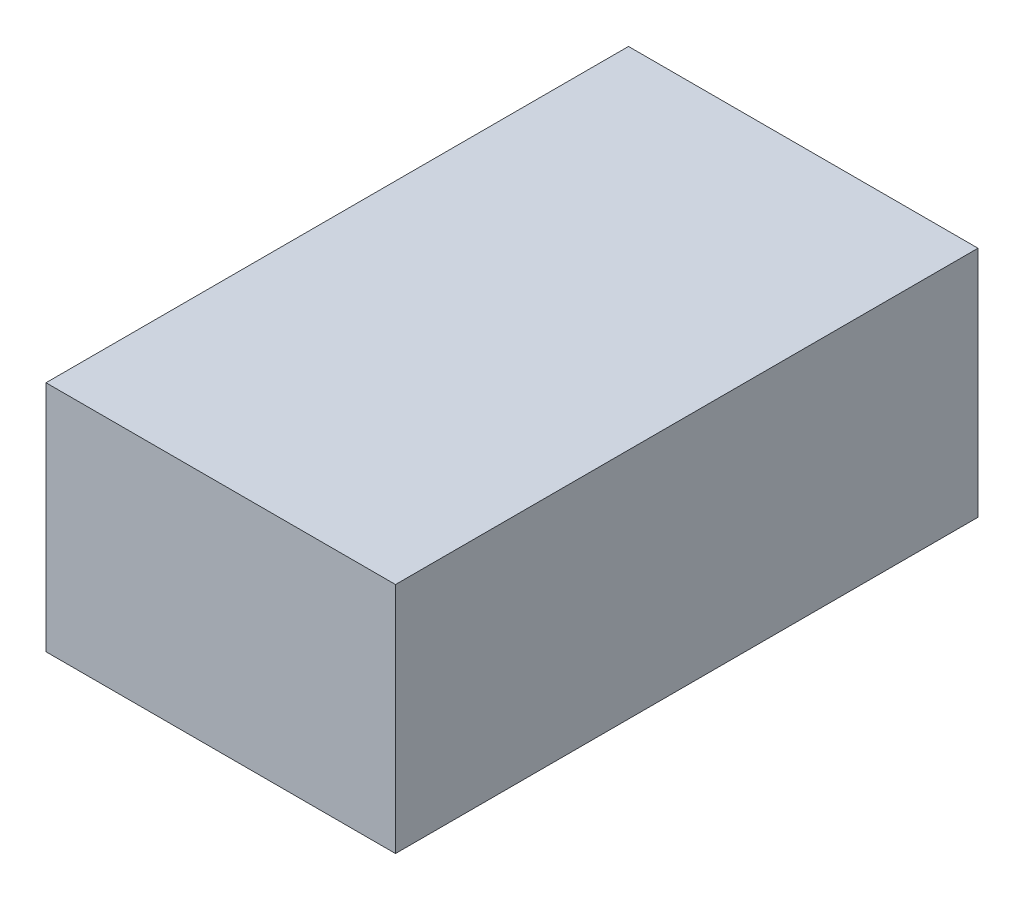
ISO-10303-21;
HEADER;
FILE_DESCRIPTION(('STEP AP214'),'2;1');
FILE_NAME('part.step','',(''),(''),'','','');
FILE_SCHEMA(('AUTOMOTIVE_DESIGN { 1 0 10303 214 1 1 1 1 }'));
ENDSEC;
DATA;
#1=APPLICATION_CONTEXT('core data for automotive mechanical design processes');
#2=APPLICATION_PROTOCOL_DEFINITION('international standard','automotive_design',2000,#1);
#3=PRODUCT_CONTEXT('',#1,'mechanical');
#4=PRODUCT('Part','Part','',(#3));
#5=PRODUCT_RELATED_PRODUCT_CATEGORY('part','',(#4));
#6=PRODUCT_DEFINITION_FORMATION('','',#4);
#7=PRODUCT_DEFINITION_CONTEXT('part definition',#1,'design');
#8=PRODUCT_DEFINITION('design','',#6,#7);
#9=PRODUCT_DEFINITION_SHAPE('','',#8);
#10=(LENGTH_UNIT() NAMED_UNIT(*) SI_UNIT(.MILLI.,.METRE.));
#11=(NAMED_UNIT(*) PLANE_ANGLE_UNIT() SI_UNIT($,.RADIAN.));
#12=(NAMED_UNIT(*) SI_UNIT($,.STERADIAN.) SOLID_ANGLE_UNIT());
#13=UNCERTAINTY_MEASURE_WITH_UNIT(LENGTH_MEASURE(1.E-05),#10,'distance_accuracy_value','');
#14=(GEOMETRIC_REPRESENTATION_CONTEXT(3) GLOBAL_UNCERTAINTY_ASSIGNED_CONTEXT((#13)) GLOBAL_UNIT_ASSIGNED_CONTEXT((#10,
#11,#12)) REPRESENTATION_CONTEXT('',''));
#15=CARTESIAN_POINT('',(0.,0.,0.));
#16=DIRECTION('',(0.,0.,1.));
#17=DIRECTION('',(1.,0.,0.));
#18=AXIS2_PLACEMENT_3D('',#15,#16,#17);
#19=CARTESIAN_POINT('',(0.3,0.4,-0.5));
#20=DIRECTION('',(-1.,0.,0.));
#21=DIRECTION('',(0.,0.,1.));
#22=AXIS2_PLACEMENT_3D('',#19,#20,#21);
#23=PLANE('',#22);
#24=DIRECTION('',(0.,0.,-1.));
#25=VECTOR('',#24,1.);
#26=CARTESIAN_POINT('',(0.3,0.,-0.5));
#27=LINE('',#26,#25);
#28=CARTESIAN_POINT('',(0.3,0.,0.5));
#29=VERTEX_POINT('',#28);
#30=CARTESIAN_POINT('',(0.3,0.,-0.5));
#31=VERTEX_POINT('',#30);
#32=EDGE_CURVE('E100',#29,#31,#27,.T.);
#33=ORIENTED_EDGE('',*,*,#32,.T.);
#34=DIRECTION('',(0.,-1.,0.));
#35=VECTOR('',#34,1.);
#36=CARTESIAN_POINT('',(0.3,0.4,-0.5));
#37=LINE('',#36,#35);
#38=CARTESIAN_POINT('',(0.3,0.4,-0.5));
#39=VERTEX_POINT('',#38);
#40=EDGE_CURVE('E11',#39,#31,#37,.T.);
#41=ORIENTED_EDGE('',*,*,#40,.F.);
#42=DIRECTION('',(0.,0.,-1.));
#43=VECTOR('',#42,1.);
#44=CARTESIAN_POINT('',(0.3,0.4,-0.5));
#45=LINE('',#44,#43);
#46=CARTESIAN_POINT('',(0.3,0.4,0.5));
#47=VERTEX_POINT('',#46);
#48=EDGE_CURVE('E88',#47,#39,#45,.T.);
#49=ORIENTED_EDGE('',*,*,#48,.F.);
#50=DIRECTION('',(0.,-1.,0.));
#51=VECTOR('',#50,1.);
#52=CARTESIAN_POINT('',(0.3,0.4,0.5));
#53=LINE('',#52,#51);
#54=EDGE_CURVE('E96',#47,#29,#53,.T.);
#55=ORIENTED_EDGE('',*,*,#54,.T.);
#56=EDGE_LOOP('',(#33,#41,#49,#55));
#57=FACE_BOUND('',#56,.T.);
#58=ADVANCED_FACE('F37',(#57),#23,.F.);
#59=CARTESIAN_POINT('',(-0.3,0.4,-0.5));
#60=DIRECTION('',(0.,0.,1.));
#61=DIRECTION('',(1.,0.,0.));
#62=AXIS2_PLACEMENT_3D('',#59,#60,#61);
#63=PLANE('',#62);
#64=DIRECTION('',(-1.,0.,0.));
#65=VECTOR('',#64,1.);
#66=CARTESIAN_POINT('',(-0.3,0.,-0.5));
#67=LINE('',#66,#65);
#68=CARTESIAN_POINT('',(-0.3,0.,-0.5));
#69=VERTEX_POINT('',#68);
#70=EDGE_CURVE('E92',#31,#69,#67,.T.);
#71=ORIENTED_EDGE('',*,*,#70,.T.);
#72=DIRECTION('',(0.,-1.,0.));
#73=VECTOR('',#72,1.);
#74=CARTESIAN_POINT('',(-0.3,0.4,-0.5));
#75=LINE('',#74,#73);
#76=CARTESIAN_POINT('',(-0.3,0.4,-0.5));
#77=VERTEX_POINT('',#76);
#78=EDGE_CURVE('E45',#77,#69,#75,.T.);
#79=ORIENTED_EDGE('',*,*,#78,.F.);
#80=DIRECTION('',(-1.,0.,0.));
#81=VECTOR('',#80,1.);
#82=CARTESIAN_POINT('',(-0.3,0.4,-0.5));
#83=LINE('',#82,#81);
#84=EDGE_CURVE('E83',#39,#77,#83,.T.);
#85=ORIENTED_EDGE('',*,*,#84,.F.);
#86=ORIENTED_EDGE('',*,*,#40,.T.);
#87=EDGE_LOOP('',(#71,#79,#85,#86));
#88=FACE_BOUND('',#87,.T.);
#89=ADVANCED_FACE('F91',(#88),#63,.F.);
#90=CARTESIAN_POINT('',(-0.3,0.4,-0.5));
#91=DIRECTION('',(1.,0.,0.));
#92=DIRECTION('',(0.,0.,-1.));
#93=AXIS2_PLACEMENT_3D('',#90,#91,#92);
#94=PLANE('',#93);
#95=DIRECTION('',(0.,0.,1.));
#96=VECTOR('',#95,1.);
#97=CARTESIAN_POINT('',(-0.3,0.,-0.5));
#98=LINE('',#97,#96);
#99=CARTESIAN_POINT('',(-0.3,0.,0.5));
#100=VERTEX_POINT('',#99);
#101=EDGE_CURVE('E70',#69,#100,#98,.T.);
#102=ORIENTED_EDGE('',*,*,#101,.T.);
#103=DIRECTION('',(0.,-1.,0.));
#104=VECTOR('',#103,1.);
#105=CARTESIAN_POINT('',(-0.3,0.4,0.5));
#106=LINE('',#105,#104);
#107=CARTESIAN_POINT('',(-0.3,0.4,0.5));
#108=VERTEX_POINT('',#107);
#109=EDGE_CURVE('E93',#108,#100,#106,.T.);
#110=ORIENTED_EDGE('',*,*,#109,.F.);
#111=DIRECTION('',(0.,0.,1.));
#112=VECTOR('',#111,1.);
#113=CARTESIAN_POINT('',(-0.3,0.4,-0.5));
#114=LINE('',#113,#112);
#115=EDGE_CURVE('E86',#77,#108,#114,.T.);
#116=ORIENTED_EDGE('',*,*,#115,.F.);
#117=ORIENTED_EDGE('',*,*,#78,.T.);
#118=EDGE_LOOP('',(#102,#110,#116,#117));
#119=FACE_BOUND('',#118,.T.);
#120=ADVANCED_FACE('F94',(#119),#94,.F.);
#121=CARTESIAN_POINT('',(-0.3,0.4,0.5));
#122=DIRECTION('',(0.,0.,-1.));
#123=DIRECTION('',(-1.,0.,0.));
#124=AXIS2_PLACEMENT_3D('',#121,#122,#123);
#125=PLANE('',#124);
#126=DIRECTION('',(1.,0.,0.));
#127=VECTOR('',#126,1.);
#128=CARTESIAN_POINT('',(-0.3,0.,0.5));
#129=LINE('',#128,#127);
#130=EDGE_CURVE('E76',#100,#29,#129,.T.);
#131=ORIENTED_EDGE('',*,*,#130,.T.);
#132=ORIENTED_EDGE('',*,*,#54,.F.);
#133=DIRECTION('',(1.,0.,0.));
#134=VECTOR('',#133,1.);
#135=CARTESIAN_POINT('',(-0.3,0.4,0.5));
#136=LINE('',#135,#134);
#137=EDGE_CURVE('E53',#108,#47,#136,.T.);
#138=ORIENTED_EDGE('',*,*,#137,.F.);
#139=ORIENTED_EDGE('',*,*,#109,.T.);
#140=EDGE_LOOP('',(#131,#132,#138,#139));
#141=FACE_BOUND('',#140,.T.);
#142=ADVANCED_FACE('F107',(#141),#125,.F.);
#143=CARTESIAN_POINT('',(0.,0.4,0.));
#144=DIRECTION('',(0.,1.,0.));
#145=DIRECTION('',(0.,0.,1.));
#146=AXIS2_PLACEMENT_3D('',#143,#144,#145);
#147=PLANE('',#146);
#148=ORIENTED_EDGE('',*,*,#48,.T.);
#149=ORIENTED_EDGE('',*,*,#84,.T.);
#150=ORIENTED_EDGE('',*,*,#115,.T.);
#151=ORIENTED_EDGE('',*,*,#137,.T.);
#152=EDGE_LOOP('',(#148,#149,#150,#151));
#153=FACE_BOUND('',#152,.T.);
#154=ADVANCED_FACE('F84',(#153),#147,.T.);
#155=CARTESIAN_POINT('',(0.,0.,0.));
#156=DIRECTION('',(0.,1.,0.));
#157=DIRECTION('',(0.,0.,1.));
#158=AXIS2_PLACEMENT_3D('',#155,#156,#157);
#159=PLANE('',#158);
#160=ORIENTED_EDGE('',*,*,#32,.F.);
#161=ORIENTED_EDGE('',*,*,#130,.F.);
#162=ORIENTED_EDGE('',*,*,#101,.F.);
#163=ORIENTED_EDGE('',*,*,#70,.F.);
#164=EDGE_LOOP('',(#160,#161,#162,#163));
#165=FACE_BOUND('',#164,.T.);
#166=ADVANCED_FACE('F110',(#165),#159,.F.);
#167=CLOSED_SHELL('',(#58,#89,#120,#142,#154,#166));
#168=MANIFOLD_SOLID_BREP('B2',#167);
#169=ADVANCED_BREP_SHAPE_REPRESENTATION('',(#18,#168),#14);
#170=SHAPE_DEFINITION_REPRESENTATION(#9,#169);
ENDSEC;
END-ISO-10303-21;
